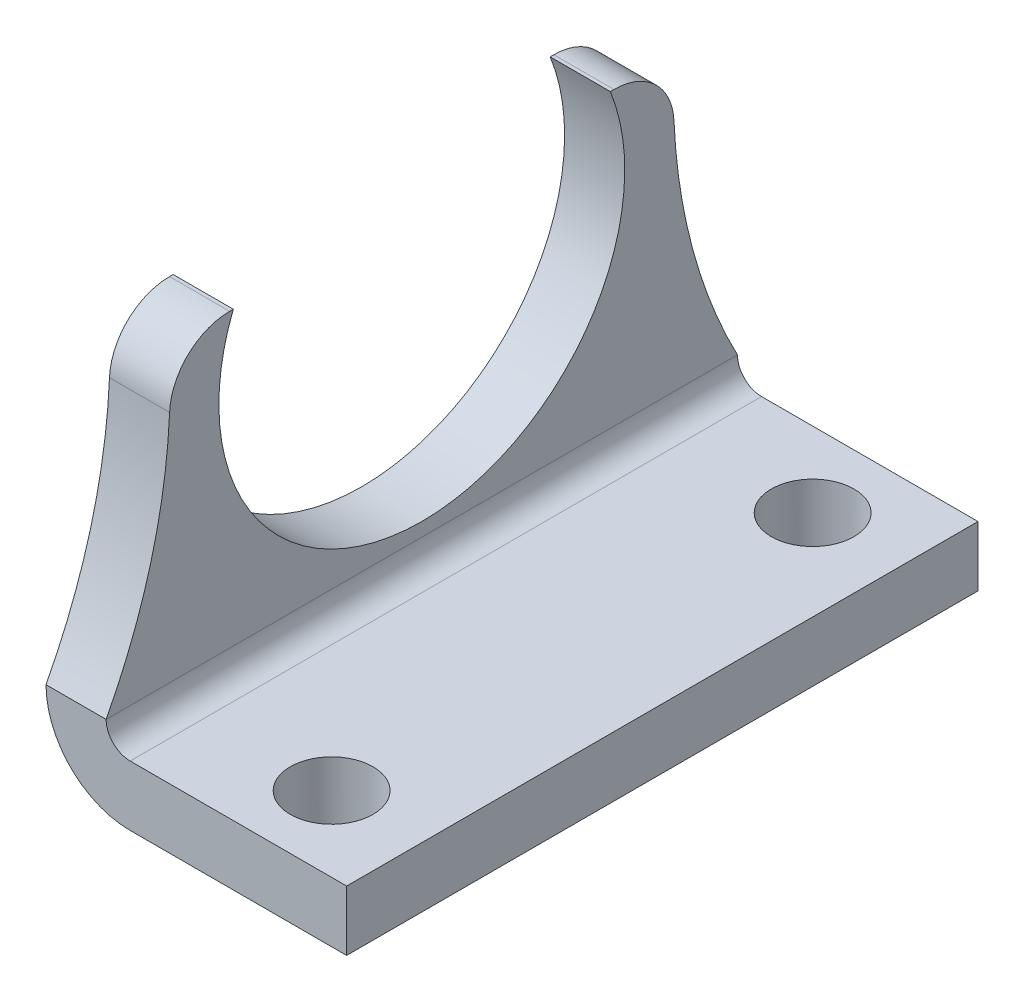
ISO-10303-21;
HEADER;
FILE_DESCRIPTION(('STEP AP214'),'2;1');
FILE_NAME('part.step','',(''),(''),'','','');
FILE_SCHEMA(('AUTOMOTIVE_DESIGN { 1 0 10303 214 1 1 1 1 }'));
ENDSEC;
DATA;
#1=APPLICATION_CONTEXT('core data for automotive mechanical design processes');
#2=APPLICATION_PROTOCOL_DEFINITION('international standard','automotive_design',2000,#1);
#3=PRODUCT_CONTEXT('',#1,'mechanical');
#4=PRODUCT('Part','Part','',(#3));
#5=PRODUCT_RELATED_PRODUCT_CATEGORY('part','',(#4));
#6=PRODUCT_DEFINITION_FORMATION('','',#4);
#7=PRODUCT_DEFINITION_CONTEXT('part definition',#1,'design');
#8=PRODUCT_DEFINITION('design','',#6,#7);
#9=PRODUCT_DEFINITION_SHAPE('','',#8);
#10=(LENGTH_UNIT() NAMED_UNIT(*) SI_UNIT(.MILLI.,.METRE.));
#11=(NAMED_UNIT(*) PLANE_ANGLE_UNIT() SI_UNIT($,.RADIAN.));
#12=(NAMED_UNIT(*) SI_UNIT($,.STERADIAN.) SOLID_ANGLE_UNIT());
#13=UNCERTAINTY_MEASURE_WITH_UNIT(LENGTH_MEASURE(1.E-05),#10,'distance_accuracy_value','');
#14=(GEOMETRIC_REPRESENTATION_CONTEXT(3) GLOBAL_UNCERTAINTY_ASSIGNED_CONTEXT((#13)) GLOBAL_UNIT_ASSIGNED_CONTEXT((#10,
#11,#12)) REPRESENTATION_CONTEXT('',''));
#15=CARTESIAN_POINT('',(0.,0.,0.));
#16=DIRECTION('',(0.,0.,1.));
#17=DIRECTION('',(1.,0.,0.));
#18=AXIS2_PLACEMENT_3D('',#15,#16,#17);
#19=CARTESIAN_POINT('',(0.,21.,-12.7815482093835));
#20=DIRECTION('',(1.,0.,0.));
#21=DIRECTION('',(0.,1.,0.));
#22=AXIS2_PLACEMENT_3D('',#19,#20,#21);
#23=CYLINDRICAL_SURFACE('',#22,4.);
#24=CARTESIAN_POINT('',(4.,21.,-12.7815482093835));
#25=DIRECTION('',(-1.,0.,0.));
#26=DIRECTION('',(0.,0.,1.));
#27=AXIS2_PLACEMENT_3D('',#24,#25,#26);
#28=CIRCLE('',#27,4.);
#29=CARTESIAN_POINT('',(4.,25.,-12.7815482093835));
#30=VERTEX_POINT('',#29);
#31=CARTESIAN_POINT('',(4.,21.1761792822867,-16.7776664334221));
#32=VERTEX_POINT('',#31);
#33=EDGE_CURVE('E11',#30,#32,#28,.T.);
#34=ORIENTED_EDGE('',*,*,#33,.T.);
#35=DIRECTION('',(-1.,0.,0.));
#36=VECTOR('',#35,1.);
#37=CARTESIAN_POINT('',(0.,21.1761792822867,-16.777666433422));
#38=LINE('',#37,#36);
#39=CARTESIAN_POINT('',(0.,21.1761792822867,-16.7776664334221));
#40=VERTEX_POINT('',#39);
#41=EDGE_CURVE('E27',#32,#40,#38,.T.);
#42=ORIENTED_EDGE('',*,*,#41,.T.);
#43=CARTESIAN_POINT('',(0.,21.,-12.7815482093835));
#44=DIRECTION('',(1.,0.,0.));
#45=DIRECTION('',(0.,1.,0.));
#46=AXIS2_PLACEMENT_3D('',#43,#44,#45);
#47=CIRCLE('',#46,4.);
#48=CARTESIAN_POINT('',(0.,25.,-12.7815482093835));
#49=VERTEX_POINT('',#48);
#50=EDGE_CURVE('E220',#40,#49,#47,.T.);
#51=ORIENTED_EDGE('',*,*,#50,.T.);
#52=DIRECTION('',(1.,0.,0.));
#53=VECTOR('',#52,1.);
#54=CARTESIAN_POINT('',(0.,25.,-12.7815482093835));
#55=LINE('',#54,#53);
#56=EDGE_CURVE('E212',#49,#30,#55,.T.);
#57=ORIENTED_EDGE('',*,*,#56,.T.);
#58=EDGE_LOOP('',(#34,#42,#51,#57));
#59=FACE_BOUND('',#58,.T.);
#60=ADVANCED_FACE('F17',(#59),#23,.T.);
#61=CARTESIAN_POINT('',(0.,25.,-12.5399362039845));
#62=DIRECTION('',(0.,-1.,0.));
#63=DIRECTION('',(0.,0.,-1.));
#64=AXIS2_PLACEMENT_3D('',#61,#62,#63);
#65=PLANE('',#64);
#66=ORIENTED_EDGE('',*,*,#56,.F.);
#67=DIRECTION('',(0.,0.,-1.));
#68=VECTOR('',#67,1.);
#69=CARTESIAN_POINT('',(0.,25.,-6.26996810199223));
#70=LINE('',#69,#68);
#71=CARTESIAN_POINT('',(0.,25.,-12.5399362039845));
#72=VERTEX_POINT('',#71);
#73=EDGE_CURVE('E202',#72,#49,#70,.T.);
#74=ORIENTED_EDGE('',*,*,#73,.F.);
#75=DIRECTION('',(-1.,0.,0.));
#76=VECTOR('',#75,1.);
#77=CARTESIAN_POINT('',(0.,25.,-12.5399362039845));
#78=LINE('',#77,#76);
#79=CARTESIAN_POINT('',(4.,25.,-12.5399362039845));
#80=VERTEX_POINT('',#79);
#81=EDGE_CURVE('E118',#80,#72,#78,.T.);
#82=ORIENTED_EDGE('',*,*,#81,.F.);
#83=DIRECTION('',(0.,0.,1.));
#84=VECTOR('',#83,1.);
#85=CARTESIAN_POINT('',(4.,25.,-6.26996810199223));
#86=LINE('',#85,#84);
#87=EDGE_CURVE('E184',#30,#80,#86,.T.);
#88=ORIENTED_EDGE('',*,*,#87,.F.);
#89=EDGE_LOOP('',(#66,#74,#82,#88));
#90=FACE_BOUND('',#89,.T.);
#91=ADVANCED_FACE('F230',(#90),#65,.F.);
#92=CARTESIAN_POINT('',(0.,40.,0.));
#93=DIRECTION('',(-1.,0.,0.));
#94=DIRECTION('',(0.,0.,1.));
#95=AXIS2_PLACEMENT_3D('',#92,#93,#94);
#96=PLANE('',#95);
#97=ORIENTED_EDGE('',*,*,#50,.F.);
#98=CARTESIAN_POINT('',(0.,22.7999999999999,-53.6093499231086));
#99=DIRECTION('',(1.,0.,0.));
#100=DIRECTION('',(0.,1.,0.));
#101=AXIS2_PLACEMENT_3D('',#98,#99,#100);
#102=CIRCLE('',#101,36.8674612959412);
#103=CARTESIAN_POINT('',(0.,5.6,-21.));
#104=VERTEX_POINT('',#103);
#105=EDGE_CURVE('E210',#40,#104,#102,.T.);
#106=ORIENTED_EDGE('',*,*,#105,.T.);
#107=DIRECTION('',(0.,0.,1.));
#108=VECTOR('',#107,1.);
#109=CARTESIAN_POINT('',(0.,5.6,0.));
#110=LINE('',#109,#108);
#111=CARTESIAN_POINT('',(0.,5.6,21.));
#112=VERTEX_POINT('',#111);
#113=EDGE_CURVE('E114',#104,#112,#110,.T.);
#114=ORIENTED_EDGE('',*,*,#113,.T.);
#115=CARTESIAN_POINT('',(0.,22.7999999999999,53.6093499231086));
#116=DIRECTION('',(1.,0.,0.));
#117=DIRECTION('',(0.,1.,0.));
#118=AXIS2_PLACEMENT_3D('',#115,#116,#117);
#119=CIRCLE('',#118,36.8674612959412);
#120=CARTESIAN_POINT('',(0.,21.1761792822867,16.7776664334221));
#121=VERTEX_POINT('',#120);
#122=EDGE_CURVE('E205',#112,#121,#119,.T.);
#123=ORIENTED_EDGE('',*,*,#122,.T.);
#124=CARTESIAN_POINT('',(0.,21.,12.7815482093835));
#125=DIRECTION('',(1.,0.,0.));
#126=DIRECTION('',(0.,1.,0.));
#127=AXIS2_PLACEMENT_3D('',#124,#125,#126);
#128=CIRCLE('',#127,4.);
#129=CARTESIAN_POINT('',(0.,25.,12.7815482093835));
#130=VERTEX_POINT('',#129);
#131=EDGE_CURVE('E197',#130,#121,#128,.T.);
#132=ORIENTED_EDGE('',*,*,#131,.F.);
#133=DIRECTION('',(0.,0.,-1.));
#134=VECTOR('',#133,1.);
#135=CARTESIAN_POINT('',(0.,25.,10.7382985715606));
#136=LINE('',#135,#134);
#137=CARTESIAN_POINT('',(0.,25.,12.5399362039845));
#138=VERTEX_POINT('',#137);
#139=EDGE_CURVE('E201',#130,#138,#136,.T.);
#140=ORIENTED_EDGE('',*,*,#139,.T.);
#141=CARTESIAN_POINT('',(0.,20.,0.));
#142=DIRECTION('',(1.,0.,0.));
#143=DIRECTION('',(0.,1.,0.));
#144=AXIS2_PLACEMENT_3D('',#141,#142,#143);
#145=CIRCLE('',#144,13.5);
#146=EDGE_CURVE('E198',#138,#72,#145,.T.);
#147=ORIENTED_EDGE('',*,*,#146,.T.);
#148=ORIENTED_EDGE('',*,*,#73,.T.);
#149=EDGE_LOOP('',(#97,#106,#114,#123,#132,#140,#147,#148));
#150=FACE_BOUND('',#149,.T.);
#151=ADVANCED_FACE('F227',(#150),#96,.T.);
#152=CARTESIAN_POINT('',(0.,21.,12.7815482093835));
#153=DIRECTION('',(-1.,0.,0.));
#154=DIRECTION('',(0.,0.,1.));
#155=AXIS2_PLACEMENT_3D('',#152,#153,#154);
#156=CYLINDRICAL_SURFACE('',#155,4.);
#157=ORIENTED_EDGE('',*,*,#131,.T.);
#158=DIRECTION('',(1.,0.,0.));
#159=VECTOR('',#158,1.);
#160=CARTESIAN_POINT('',(0.,21.1761792822867,16.777666433422));
#161=LINE('',#160,#159);
#162=CARTESIAN_POINT('',(4.,21.1761792822867,16.7776664334221));
#163=VERTEX_POINT('',#162);
#164=EDGE_CURVE('E194',#121,#163,#161,.T.);
#165=ORIENTED_EDGE('',*,*,#164,.T.);
#166=CARTESIAN_POINT('',(4.,21.,12.7815482093835));
#167=DIRECTION('',(-1.,0.,0.));
#168=DIRECTION('',(0.,0.,1.));
#169=AXIS2_PLACEMENT_3D('',#166,#167,#168);
#170=CIRCLE('',#169,4.);
#171=CARTESIAN_POINT('',(4.,25.,12.7815482093835));
#172=VERTEX_POINT('',#171);
#173=EDGE_CURVE('E191',#163,#172,#170,.T.);
#174=ORIENTED_EDGE('',*,*,#173,.T.);
#175=DIRECTION('',(-1.,0.,0.));
#176=VECTOR('',#175,1.);
#177=CARTESIAN_POINT('',(0.,25.,12.7815482093835));
#178=LINE('',#177,#176);
#179=EDGE_CURVE('E188',#172,#130,#178,.T.);
#180=ORIENTED_EDGE('',*,*,#179,.T.);
#181=EDGE_LOOP('',(#157,#165,#174,#180));
#182=FACE_BOUND('',#181,.T.);
#183=ADVANCED_FACE('F257',(#182),#156,.T.);
#184=CARTESIAN_POINT('',(0.,25.,21.4765971431211));
#185=DIRECTION('',(0.,-1.,0.));
#186=DIRECTION('',(0.,0.,-1.));
#187=AXIS2_PLACEMENT_3D('',#184,#185,#186);
#188=PLANE('',#187);
#189=ORIENTED_EDGE('',*,*,#179,.F.);
#190=DIRECTION('',(0.,0.,1.));
#191=VECTOR('',#190,1.);
#192=CARTESIAN_POINT('',(4.,25.,10.7382985715606));
#193=LINE('',#192,#191);
#194=CARTESIAN_POINT('',(4.,25.,12.5399362039845));
#195=VERTEX_POINT('',#194);
#196=EDGE_CURVE('E180',#195,#172,#193,.T.);
#197=ORIENTED_EDGE('',*,*,#196,.F.);
#198=DIRECTION('',(1.,0.,0.));
#199=VECTOR('',#198,1.);
#200=CARTESIAN_POINT('',(0.,25.,12.5399362039845));
#201=LINE('',#200,#199);
#202=EDGE_CURVE('E177',#138,#195,#201,.T.);
#203=ORIENTED_EDGE('',*,*,#202,.F.);
#204=ORIENTED_EDGE('',*,*,#139,.F.);
#205=EDGE_LOOP('',(#189,#197,#203,#204));
#206=FACE_BOUND('',#205,.T.);
#207=ADVANCED_FACE('F255',(#206),#188,.F.);
#208=CARTESIAN_POINT('',(4.,5.6,0.));
#209=DIRECTION('',(1.,0.,0.));
#210=DIRECTION('',(0.,0.,-1.));
#211=AXIS2_PLACEMENT_3D('',#208,#209,#210);
#212=PLANE('',#211);
#213=ORIENTED_EDGE('',*,*,#33,.F.);
#214=ORIENTED_EDGE('',*,*,#87,.T.);
#215=CARTESIAN_POINT('',(4.,20.,0.));
#216=DIRECTION('',(-1.,0.,0.));
#217=DIRECTION('',(0.,0.,1.));
#218=AXIS2_PLACEMENT_3D('',#215,#216,#217);
#219=CIRCLE('',#218,13.5);
#220=EDGE_CURVE('E181',#80,#195,#219,.T.);
#221=ORIENTED_EDGE('',*,*,#220,.T.);
#222=ORIENTED_EDGE('',*,*,#196,.T.);
#223=ORIENTED_EDGE('',*,*,#173,.F.);
#224=CARTESIAN_POINT('',(4.,22.7999999999999,53.6093499231086));
#225=DIRECTION('',(-1.,0.,0.));
#226=DIRECTION('',(0.,0.,1.));
#227=AXIS2_PLACEMENT_3D('',#224,#225,#226);
#228=CIRCLE('',#227,36.8674612959412);
#229=CARTESIAN_POINT('',(4.,5.6,21.));
#230=VERTEX_POINT('',#229);
#231=EDGE_CURVE('E175',#163,#230,#228,.T.);
#232=ORIENTED_EDGE('',*,*,#231,.T.);
#233=DIRECTION('',(0.,0.,1.));
#234=VECTOR('',#233,1.);
#235=CARTESIAN_POINT('',(4.,5.6,0.));
#236=LINE('',#235,#234);
#237=CARTESIAN_POINT('',(4.,5.6,-21.));
#238=VERTEX_POINT('',#237);
#239=EDGE_CURVE('E148',#238,#230,#236,.T.);
#240=ORIENTED_EDGE('',*,*,#239,.F.);
#241=CARTESIAN_POINT('',(4.,22.7999999999999,-53.6093499231086));
#242=DIRECTION('',(-1.,0.,0.));
#243=DIRECTION('',(0.,0.,1.));
#244=AXIS2_PLACEMENT_3D('',#241,#242,#243);
#245=CIRCLE('',#244,36.8674612959412);
#246=EDGE_CURVE('E172',#238,#32,#245,.T.);
#247=ORIENTED_EDGE('',*,*,#246,.T.);
#248=EDGE_LOOP('',(#213,#214,#221,#222,#223,#232,#240,#247));
#249=FACE_BOUND('',#248,.T.);
#250=ADVANCED_FACE('F233',(#249),#212,.T.);
#251=CARTESIAN_POINT('',(0.,22.7999999999999,53.6093499231086));
#252=DIRECTION('',(1.,0.,0.));
#253=DIRECTION('',(0.,1.,0.));
#254=AXIS2_PLACEMENT_3D('',#251,#252,#253);
#255=CYLINDRICAL_SURFACE('',#254,36.8674612959412);
#256=ORIENTED_EDGE('',*,*,#164,.F.);
#257=ORIENTED_EDGE('',*,*,#122,.F.);
#258=DIRECTION('',(-1.,0.,0.));
#259=VECTOR('',#258,1.);
#260=CARTESIAN_POINT('',(0.,5.60000000000047,21.));
#261=LINE('',#260,#259);
#262=EDGE_CURVE('E169',#230,#112,#261,.T.);
#263=ORIENTED_EDGE('',*,*,#262,.F.);
#264=ORIENTED_EDGE('',*,*,#231,.F.);
#265=EDGE_LOOP('',(#256,#257,#263,#264));
#266=FACE_BOUND('',#265,.T.);
#267=ADVANCED_FACE('F250',(#266),#255,.F.);
#268=CARTESIAN_POINT('',(0.,22.7999999999999,-53.6093499231086));
#269=DIRECTION('',(1.,0.,0.));
#270=DIRECTION('',(0.,1.,0.));
#271=AXIS2_PLACEMENT_3D('',#268,#269,#270);
#272=CYLINDRICAL_SURFACE('',#271,36.8674612959412);
#273=ORIENTED_EDGE('',*,*,#41,.F.);
#274=ORIENTED_EDGE('',*,*,#246,.F.);
#275=DIRECTION('',(1.,0.,0.));
#276=VECTOR('',#275,1.);
#277=CARTESIAN_POINT('',(0.,5.60000000000047,-21.));
#278=LINE('',#277,#276);
#279=EDGE_CURVE('E156',#104,#238,#278,.T.);
#280=ORIENTED_EDGE('',*,*,#279,.F.);
#281=ORIENTED_EDGE('',*,*,#105,.F.);
#282=EDGE_LOOP('',(#273,#274,#280,#281));
#283=FACE_BOUND('',#282,.T.);
#284=ADVANCED_FACE('F225',(#283),#272,.F.);
#285=CARTESIAN_POINT('',(5.40224791127203,15.9209699064251,21.));
#286=DIRECTION('',(0.,0.,1.));
#287=DIRECTION('',(1.,0.,0.));
#288=AXIS2_PLACEMENT_3D('',#285,#286,#287);
#289=PLANE('',#288);
#290=ORIENTED_EDGE('',*,*,#262,.T.);
#291=CARTESIAN_POINT('',(5.59999999999989,5.59999999999989,21.));
#292=DIRECTION('',(0.,0.,1.));
#293=DIRECTION('',(1.,0.,0.));
#294=AXIS2_PLACEMENT_3D('',#291,#292,#293);
#295=CIRCLE('',#294,5.59999999999989);
#296=CARTESIAN_POINT('',(5.6,0.,21.));
#297=VERTEX_POINT('',#296);
#298=EDGE_CURVE('E167',#112,#297,#295,.T.);
#299=ORIENTED_EDGE('',*,*,#298,.T.);
#300=DIRECTION('',(1.,0.,0.));
#301=VECTOR('',#300,1.);
#302=CARTESIAN_POINT('',(5.6,0.,21.));
#303=LINE('',#302,#301);
#304=CARTESIAN_POINT('',(20.,0.,21.));
#305=VERTEX_POINT('',#304);
#306=EDGE_CURVE('E127',#297,#305,#303,.T.);
#307=ORIENTED_EDGE('',*,*,#306,.T.);
#308=DIRECTION('',(0.,1.,0.));
#309=VECTOR('',#308,1.);
#310=CARTESIAN_POINT('',(20.,0.,21.));
#311=LINE('',#310,#309);
#312=CARTESIAN_POINT('',(20.,4.,21.));
#313=VERTEX_POINT('',#312);
#314=EDGE_CURVE('E163',#305,#313,#311,.T.);
#315=ORIENTED_EDGE('',*,*,#314,.T.);
#316=DIRECTION('',(-1.,0.,0.));
#317=VECTOR('',#316,1.);
#318=CARTESIAN_POINT('',(20.,4.,21.));
#319=LINE('',#318,#317);
#320=CARTESIAN_POINT('',(5.6,4.,21.));
#321=VERTEX_POINT('',#320);
#322=EDGE_CURVE('E160',#313,#321,#319,.T.);
#323=ORIENTED_EDGE('',*,*,#322,.T.);
#324=CARTESIAN_POINT('',(5.59999999999992,5.59999999999992,21.));
#325=DIRECTION('',(0.,0.,-1.));
#326=DIRECTION('',(0.,-1.,0.));
#327=AXIS2_PLACEMENT_3D('',#324,#325,#326);
#328=CIRCLE('',#327,1.59999999999992);
#329=EDGE_CURVE('E157',#321,#230,#328,.T.);
#330=ORIENTED_EDGE('',*,*,#329,.T.);
#331=EDGE_LOOP('',(#290,#299,#307,#315,#323,#330));
#332=FACE_BOUND('',#331,.T.);
#333=ADVANCED_FACE('F245',(#332),#289,.T.);
#334=CARTESIAN_POINT('',(5.40224791127203,15.9209699064251,-21.));
#335=DIRECTION('',(0.,0.,1.));
#336=DIRECTION('',(1.,0.,0.));
#337=AXIS2_PLACEMENT_3D('',#334,#335,#336);
#338=PLANE('',#337);
#339=ORIENTED_EDGE('',*,*,#279,.T.);
#340=CARTESIAN_POINT('',(5.59999999999992,5.59999999999992,-21.));
#341=DIRECTION('',(0.,0.,1.));
#342=DIRECTION('',(1.,0.,0.));
#343=AXIS2_PLACEMENT_3D('',#340,#341,#342);
#344=CIRCLE('',#343,1.59999999999992);
#345=CARTESIAN_POINT('',(5.6,4.,-21.));
#346=VERTEX_POINT('',#345);
#347=EDGE_CURVE('E153',#238,#346,#344,.T.);
#348=ORIENTED_EDGE('',*,*,#347,.T.);
#349=DIRECTION('',(1.,0.,0.));
#350=VECTOR('',#349,1.);
#351=CARTESIAN_POINT('',(20.,4.,-21.));
#352=LINE('',#351,#350);
#353=CARTESIAN_POINT('',(20.,4.,-21.));
#354=VERTEX_POINT('',#353);
#355=EDGE_CURVE('E151',#346,#354,#352,.T.);
#356=ORIENTED_EDGE('',*,*,#355,.T.);
#357=DIRECTION('',(0.,-1.,0.));
#358=VECTOR('',#357,1.);
#359=CARTESIAN_POINT('',(20.,0.,-21.));
#360=LINE('',#359,#358);
#361=CARTESIAN_POINT('',(20.,0.,-21.));
#362=VERTEX_POINT('',#361);
#363=EDGE_CURVE('E122',#354,#362,#360,.T.);
#364=ORIENTED_EDGE('',*,*,#363,.T.);
#365=DIRECTION('',(-1.,0.,0.));
#366=VECTOR('',#365,1.);
#367=CARTESIAN_POINT('',(5.6,0.,-21.));
#368=LINE('',#367,#366);
#369=CARTESIAN_POINT('',(5.6,0.,-21.));
#370=VERTEX_POINT('',#369);
#371=EDGE_CURVE('E103',#362,#370,#368,.T.);
#372=ORIENTED_EDGE('',*,*,#371,.T.);
#373=CARTESIAN_POINT('',(5.59999999999989,5.59999999999989,-21.));
#374=DIRECTION('',(0.,0.,-1.));
#375=DIRECTION('',(0.,-1.,0.));
#376=AXIS2_PLACEMENT_3D('',#373,#374,#375);
#377=CIRCLE('',#376,5.59999999999989);
#378=EDGE_CURVE('E110',#370,#104,#377,.T.);
#379=ORIENTED_EDGE('',*,*,#378,.T.);
#380=EDGE_LOOP('',(#339,#348,#356,#364,#372,#379));
#381=FACE_BOUND('',#380,.T.);
#382=ADVANCED_FACE('F120',(#381),#338,.F.);
#383=CARTESIAN_POINT('',(14.,0.,16.));
#384=DIRECTION('',(0.,1.,0.));
#385=DIRECTION('',(1.,0.,0.));
#386=AXIS2_PLACEMENT_3D('',#383,#384,#385);
#387=CYLINDRICAL_SURFACE('',#386,2.75);
#388=CARTESIAN_POINT('',(14.,4.,16.));
#389=DIRECTION('',(0.,-1.,0.));
#390=DIRECTION('',(0.,0.,-1.));
#391=AXIS2_PLACEMENT_3D('',#388,#389,#390);
#392=CIRCLE('',#391,2.75);
#393=CARTESIAN_POINT('',(14.,4.,13.25));
#394=VERTEX_POINT('',#393);
#395=EDGE_CURVE('E144',#394,#394,#392,.T.);
#396=ORIENTED_EDGE('',*,*,#395,.F.);
#397=EDGE_LOOP('',(#396));
#398=FACE_BOUND('',#397,.T.);
#399=CARTESIAN_POINT('',(14.,0.,16.));
#400=DIRECTION('',(0.,1.,0.));
#401=DIRECTION('',(1.,0.,0.));
#402=AXIS2_PLACEMENT_3D('',#399,#400,#401);
#403=CIRCLE('',#402,2.75);
#404=CARTESIAN_POINT('',(16.75,0.,16.));
#405=VERTEX_POINT('',#404);
#406=EDGE_CURVE('E132',#405,#405,#403,.T.);
#407=ORIENTED_EDGE('',*,*,#406,.F.);
#408=EDGE_LOOP('',(#407));
#409=FACE_BOUND('',#408,.T.);
#410=ADVANCED_FACE('F268',(#398,#409),#387,.F.);
#411=CARTESIAN_POINT('',(14.,0.,-16.));
#412=DIRECTION('',(0.,1.,0.));
#413=DIRECTION('',(1.,0.,0.));
#414=AXIS2_PLACEMENT_3D('',#411,#412,#413);
#415=CYLINDRICAL_SURFACE('',#414,2.75);
#416=CARTESIAN_POINT('',(14.,4.,-16.));
#417=DIRECTION('',(0.,-1.,0.));
#418=DIRECTION('',(0.,0.,-1.));
#419=AXIS2_PLACEMENT_3D('',#416,#417,#418);
#420=CIRCLE('',#419,2.75);
#421=CARTESIAN_POINT('',(14.,4.,-18.75));
#422=VERTEX_POINT('',#421);
#423=EDGE_CURVE('E140',#422,#422,#420,.T.);
#424=ORIENTED_EDGE('',*,*,#423,.F.);
#425=EDGE_LOOP('',(#424));
#426=FACE_BOUND('',#425,.T.);
#427=CARTESIAN_POINT('',(14.,0.,-16.));
#428=DIRECTION('',(0.,1.,0.));
#429=DIRECTION('',(1.,0.,0.));
#430=AXIS2_PLACEMENT_3D('',#427,#428,#429);
#431=CIRCLE('',#430,2.75);
#432=CARTESIAN_POINT('',(16.75,0.,-16.));
#433=VERTEX_POINT('',#432);
#434=EDGE_CURVE('E130',#433,#433,#431,.T.);
#435=ORIENTED_EDGE('',*,*,#434,.F.);
#436=EDGE_LOOP('',(#435));
#437=FACE_BOUND('',#436,.T.);
#438=ADVANCED_FACE('F261',(#426,#437),#415,.F.);
#439=CARTESIAN_POINT('',(0.,20.,0.));
#440=DIRECTION('',(1.,0.,0.));
#441=DIRECTION('',(0.,1.,0.));
#442=AXIS2_PLACEMENT_3D('',#439,#440,#441);
#443=CYLINDRICAL_SURFACE('',#442,13.5);
#444=ORIENTED_EDGE('',*,*,#81,.T.);
#445=ORIENTED_EDGE('',*,*,#146,.F.);
#446=ORIENTED_EDGE('',*,*,#202,.T.);
#447=ORIENTED_EDGE('',*,*,#220,.F.);
#448=EDGE_LOOP('',(#444,#445,#446,#447));
#449=FACE_BOUND('',#448,.T.);
#450=ADVANCED_FACE('F259',(#449),#443,.F.);
#451=CARTESIAN_POINT('',(5.59999999999992,5.59999999999992,0.));
#452=DIRECTION('',(0.,0.,1.));
#453=DIRECTION('',(1.,0.,0.));
#454=AXIS2_PLACEMENT_3D('',#451,#452,#453);
#455=CYLINDRICAL_SURFACE('',#454,1.59999999999992);
#456=ORIENTED_EDGE('',*,*,#239,.T.);
#457=ORIENTED_EDGE('',*,*,#329,.F.);
#458=DIRECTION('',(0.,0.,1.));
#459=VECTOR('',#458,1.);
#460=CARTESIAN_POINT('',(5.6,4.,0.));
#461=LINE('',#460,#459);
#462=EDGE_CURVE('E138',#346,#321,#461,.T.);
#463=ORIENTED_EDGE('',*,*,#462,.F.);
#464=ORIENTED_EDGE('',*,*,#347,.F.);
#465=EDGE_LOOP('',(#456,#457,#463,#464));
#466=FACE_BOUND('',#465,.T.);
#467=ADVANCED_FACE('F19',(#466),#455,.F.);
#468=CARTESIAN_POINT('',(20.,4.,0.));
#469=DIRECTION('',(0.,1.,0.));
#470=DIRECTION('',(0.,0.,1.));
#471=AXIS2_PLACEMENT_3D('',#468,#469,#470);
#472=PLANE('',#471);
#473=ORIENTED_EDGE('',*,*,#395,.T.);
#474=EDGE_LOOP('',(#473));
#475=FACE_BOUND('',#474,.T.);
#476=ORIENTED_EDGE('',*,*,#423,.T.);
#477=EDGE_LOOP('',(#476));
#478=FACE_BOUND('',#477,.T.);
#479=ORIENTED_EDGE('',*,*,#462,.T.);
#480=ORIENTED_EDGE('',*,*,#322,.F.);
#481=DIRECTION('',(0.,0.,1.));
#482=VECTOR('',#481,1.);
#483=CARTESIAN_POINT('',(20.,4.,0.));
#484=LINE('',#483,#482);
#485=EDGE_CURVE('E135',#354,#313,#484,.T.);
#486=ORIENTED_EDGE('',*,*,#485,.F.);
#487=ORIENTED_EDGE('',*,*,#355,.F.);
#488=EDGE_LOOP('',(#479,#480,#486,#487));
#489=FACE_BOUND('',#488,.T.);
#490=ADVANCED_FACE('F241',(#475,#478,#489),#472,.T.);
#491=CARTESIAN_POINT('',(20.,0.,0.));
#492=DIRECTION('',(1.,0.,0.));
#493=DIRECTION('',(0.,0.,-1.));
#494=AXIS2_PLACEMENT_3D('',#491,#492,#493);
#495=PLANE('',#494);
#496=ORIENTED_EDGE('',*,*,#485,.T.);
#497=ORIENTED_EDGE('',*,*,#314,.F.);
#498=DIRECTION('',(0.,0.,1.));
#499=VECTOR('',#498,1.);
#500=CARTESIAN_POINT('',(20.,0.,0.));
#501=LINE('',#500,#499);
#502=EDGE_CURVE('E129',#362,#305,#501,.T.);
#503=ORIENTED_EDGE('',*,*,#502,.F.);
#504=ORIENTED_EDGE('',*,*,#363,.F.);
#505=EDGE_LOOP('',(#496,#497,#503,#504));
#506=FACE_BOUND('',#505,.T.);
#507=ADVANCED_FACE('F243',(#506),#495,.T.);
#508=CARTESIAN_POINT('',(5.6,0.,0.));
#509=DIRECTION('',(0.,-1.,0.));
#510=DIRECTION('',(0.,0.,-1.));
#511=AXIS2_PLACEMENT_3D('',#508,#509,#510);
#512=PLANE('',#511);
#513=ORIENTED_EDGE('',*,*,#406,.T.);
#514=EDGE_LOOP('',(#513));
#515=FACE_BOUND('',#514,.T.);
#516=ORIENTED_EDGE('',*,*,#434,.T.);
#517=EDGE_LOOP('',(#516));
#518=FACE_BOUND('',#517,.T.);
#519=ORIENTED_EDGE('',*,*,#502,.T.);
#520=ORIENTED_EDGE('',*,*,#306,.F.);
#521=DIRECTION('',(0.,0.,1.));
#522=VECTOR('',#521,1.);
#523=CARTESIAN_POINT('',(5.6,0.,0.));
#524=LINE('',#523,#522);
#525=EDGE_CURVE('E21',#370,#297,#524,.T.);
#526=ORIENTED_EDGE('',*,*,#525,.F.);
#527=ORIENTED_EDGE('',*,*,#371,.F.);
#528=EDGE_LOOP('',(#519,#520,#526,#527));
#529=FACE_BOUND('',#528,.T.);
#530=ADVANCED_FACE('F125',(#515,#518,#529),#512,.T.);
#531=CARTESIAN_POINT('',(5.59999999999989,5.59999999999989,0.));
#532=DIRECTION('',(0.,0.,1.));
#533=DIRECTION('',(1.,0.,0.));
#534=AXIS2_PLACEMENT_3D('',#531,#532,#533);
#535=CYLINDRICAL_SURFACE('',#534,5.59999999999989);
#536=ORIENTED_EDGE('',*,*,#525,.T.);
#537=ORIENTED_EDGE('',*,*,#298,.F.);
#538=ORIENTED_EDGE('',*,*,#113,.F.);
#539=ORIENTED_EDGE('',*,*,#378,.F.);
#540=EDGE_LOOP('',(#536,#537,#538,#539));
#541=FACE_BOUND('',#540,.T.);
#542=ADVANCED_FACE('F111',(#541),#535,.T.);
#543=CLOSED_SHELL('',(#60,#91,#151,#183,#207,#250,#267,#284,#333,#382,#410,#438,#450,#467,#490,
#507,#530,#542));
#544=MANIFOLD_SOLID_BREP('B1',#543);
#545=ADVANCED_BREP_SHAPE_REPRESENTATION('',(#18,#544),#14);
#546=SHAPE_DEFINITION_REPRESENTATION(#9,#545);
ENDSEC;
END-ISO-10303-21;
